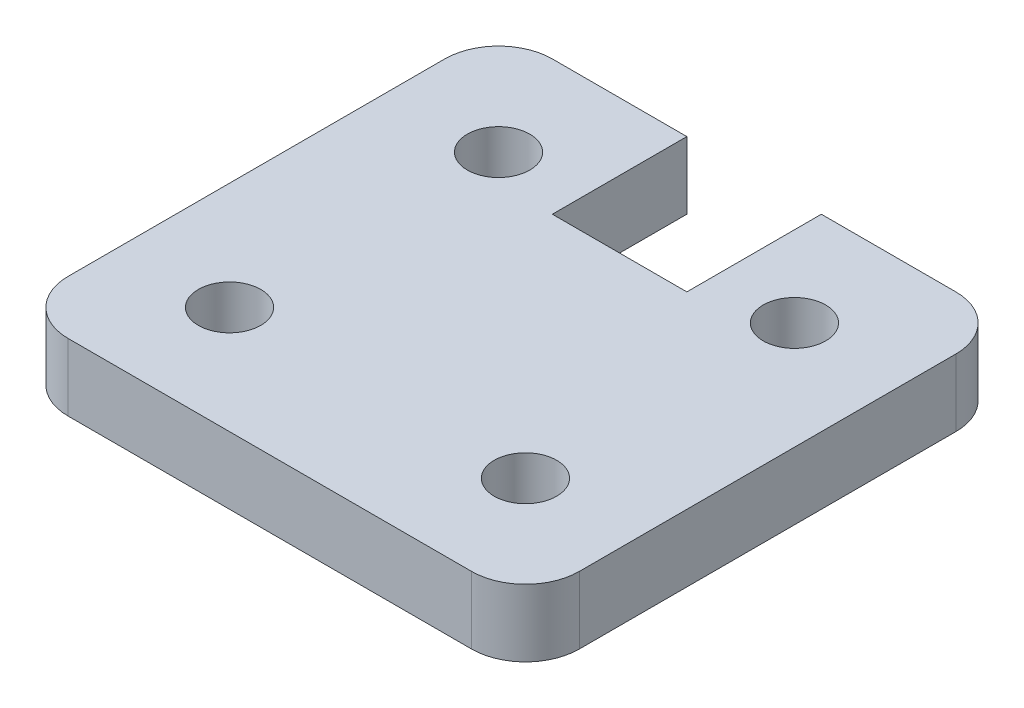
ISO-10303-21;
HEADER;
FILE_DESCRIPTION(('STEP AP214'),'2;1');
FILE_NAME('part.step','',(''),(''),'','','');
FILE_SCHEMA(('AUTOMOTIVE_DESIGN { 1 0 10303 214 1 1 1 1 }'));
ENDSEC;
DATA;
#1=APPLICATION_CONTEXT('core data for automotive mechanical design processes');
#2=APPLICATION_PROTOCOL_DEFINITION('international standard','automotive_design',2000,#1);
#3=PRODUCT_CONTEXT('',#1,'mechanical');
#4=PRODUCT('Part','Part','',(#3));
#5=PRODUCT_RELATED_PRODUCT_CATEGORY('part','',(#4));
#6=PRODUCT_DEFINITION_FORMATION('','',#4);
#7=PRODUCT_DEFINITION_CONTEXT('part definition',#1,'design');
#8=PRODUCT_DEFINITION('design','',#6,#7);
#9=PRODUCT_DEFINITION_SHAPE('','',#8);
#10=(LENGTH_UNIT() NAMED_UNIT(*) SI_UNIT(.MILLI.,.METRE.));
#11=(NAMED_UNIT(*) PLANE_ANGLE_UNIT() SI_UNIT($,.RADIAN.));
#12=(NAMED_UNIT(*) SI_UNIT($,.STERADIAN.) SOLID_ANGLE_UNIT());
#13=UNCERTAINTY_MEASURE_WITH_UNIT(LENGTH_MEASURE(1.E-05),#10,'distance_accuracy_value','');
#14=(GEOMETRIC_REPRESENTATION_CONTEXT(3) GLOBAL_UNCERTAINTY_ASSIGNED_CONTEXT((#13)) GLOBAL_UNIT_ASSIGNED_CONTEXT((#10,
#11,#12)) REPRESENTATION_CONTEXT('',''));
#15=CARTESIAN_POINT('',(0.,0.,0.));
#16=DIRECTION('',(0.,0.,1.));
#17=DIRECTION('',(1.,0.,0.));
#18=AXIS2_PLACEMENT_3D('',#15,#16,#17);
#19=CARTESIAN_POINT('',(-12.065,3.175,-11.43));
#20=DIRECTION('',(0.,0.,1.));
#21=DIRECTION('',(1.,0.,0.));
#22=AXIS2_PLACEMENT_3D('',#19,#20,#21);
#23=PLANE('',#22);
#24=DIRECTION('',(-1.,0.,0.));
#25=VECTOR('',#24,1.);
#26=CARTESIAN_POINT('',(-12.065,0.,-11.43));
#27=LINE('',#26,#25);
#28=CARTESIAN_POINT('',(9.525,0.,-11.43));
#29=VERTEX_POINT('',#28);
#30=CARTESIAN_POINT('',(3.17499999999999,0.,-11.43));
#31=VERTEX_POINT('',#30);
#32=EDGE_CURVE('E144',#29,#31,#27,.T.);
#33=ORIENTED_EDGE('',*,*,#32,.T.);
#34=DIRECTION('',(0.,1.,0.));
#35=VECTOR('',#34,1.);
#36=CARTESIAN_POINT('',(3.17499999999999,0.,-11.43));
#37=LINE('',#36,#35);
#38=CARTESIAN_POINT('',(3.17499999999999,3.175,-11.43));
#39=VERTEX_POINT('',#38);
#40=EDGE_CURVE('E128',#31,#39,#37,.T.);
#41=ORIENTED_EDGE('',*,*,#40,.T.);
#42=DIRECTION('',(-1.,0.,0.));
#43=VECTOR('',#42,1.);
#44=CARTESIAN_POINT('',(-12.065,3.175,-11.43));
#45=LINE('',#44,#43);
#46=CARTESIAN_POINT('',(9.525,3.175,-11.43));
#47=VERTEX_POINT('',#46);
#48=EDGE_CURVE('E217',#47,#39,#45,.T.);
#49=ORIENTED_EDGE('',*,*,#48,.F.);
#50=DIRECTION('',(0.,-1.,0.));
#51=VECTOR('',#50,1.);
#52=CARTESIAN_POINT('',(9.525,3.175,-11.43));
#53=LINE('',#52,#51);
#54=EDGE_CURVE('E151',#47,#29,#53,.T.);
#55=ORIENTED_EDGE('',*,*,#54,.T.);
#56=EDGE_LOOP('',(#33,#41,#49,#55));
#57=FACE_BOUND('',#56,.T.);
#58=ADVANCED_FACE('F39',(#57),#23,.F.);
#59=CARTESIAN_POINT('',(12.065,3.175,11.43));
#60=DIRECTION('',(-1.,0.,0.));
#61=DIRECTION('',(0.,0.,1.));
#62=AXIS2_PLACEMENT_3D('',#59,#60,#61);
#63=PLANE('',#62);
#64=DIRECTION('',(0.,0.,-1.));
#65=VECTOR('',#64,1.);
#66=CARTESIAN_POINT('',(12.065,0.,11.43));
#67=LINE('',#66,#65);
#68=CARTESIAN_POINT('',(12.065,0.,8.89));
#69=VERTEX_POINT('',#68);
#70=CARTESIAN_POINT('',(12.065,0.,-8.89));
#71=VERTEX_POINT('',#70);
#72=EDGE_CURVE('E158',#69,#71,#67,.T.);
#73=ORIENTED_EDGE('',*,*,#72,.T.);
#74=DIRECTION('',(0.,-1.,0.));
#75=VECTOR('',#74,1.);
#76=CARTESIAN_POINT('',(12.065,3.175,-8.89));
#77=LINE('',#76,#75);
#78=CARTESIAN_POINT('',(12.065,3.175,-8.89));
#79=VERTEX_POINT('',#78);
#80=EDGE_CURVE('E194',#71,#79,#77,.F.);
#81=ORIENTED_EDGE('',*,*,#80,.T.);
#82=DIRECTION('',(0.,0.,-1.));
#83=VECTOR('',#82,1.);
#84=CARTESIAN_POINT('',(12.065,3.175,11.43));
#85=LINE('',#84,#83);
#86=CARTESIAN_POINT('',(12.065,3.175,8.89));
#87=VERTEX_POINT('',#86);
#88=EDGE_CURVE('E163',#87,#79,#85,.T.);
#89=ORIENTED_EDGE('',*,*,#88,.F.);
#90=DIRECTION('',(0.,-1.,0.));
#91=VECTOR('',#90,1.);
#92=CARTESIAN_POINT('',(12.065,3.175,8.89));
#93=LINE('',#92,#91);
#94=EDGE_CURVE('E191',#87,#69,#93,.T.);
#95=ORIENTED_EDGE('',*,*,#94,.T.);
#96=EDGE_LOOP('',(#73,#81,#89,#95));
#97=FACE_BOUND('',#96,.T.);
#98=ADVANCED_FACE('F210',(#97),#63,.F.);
#99=CARTESIAN_POINT('',(-3.17500000000001,3.175,-11.43));
#100=VERTEX_POINT('',#99);
#101=CARTESIAN_POINT('',(-9.525,3.175,-11.43));
#102=VERTEX_POINT('',#101);
#103=EDGE_CURVE('E215',#100,#102,#45,.T.);
#104=ORIENTED_EDGE('',*,*,#103,.F.);
#105=DIRECTION('',(0.,1.,0.));
#106=VECTOR('',#105,1.);
#107=CARTESIAN_POINT('',(-3.17500000000001,0.,-11.43));
#108=LINE('',#107,#106);
#109=CARTESIAN_POINT('',(-3.17500000000001,0.,-11.43));
#110=VERTEX_POINT('',#109);
#111=EDGE_CURVE('E138',#110,#100,#108,.T.);
#112=ORIENTED_EDGE('',*,*,#111,.F.);
#113=CARTESIAN_POINT('',(-9.525,0.,-11.43));
#114=VERTEX_POINT('',#113);
#115=EDGE_CURVE('E153',#110,#114,#27,.T.);
#116=ORIENTED_EDGE('',*,*,#115,.T.);
#117=DIRECTION('',(0.,-1.,0.));
#118=VECTOR('',#117,1.);
#119=CARTESIAN_POINT('',(-9.525,3.175,-11.43));
#120=LINE('',#119,#118);
#121=EDGE_CURVE('E180',#114,#102,#120,.F.);
#122=ORIENTED_EDGE('',*,*,#121,.T.);
#123=EDGE_LOOP('',(#104,#112,#116,#122));
#124=FACE_BOUND('',#123,.T.);
#125=ADVANCED_FACE('F238',(#124),#23,.F.);
#126=CARTESIAN_POINT('',(-12.065,3.175,11.43));
#127=DIRECTION('',(1.,0.,0.));
#128=DIRECTION('',(0.,0.,-1.));
#129=AXIS2_PLACEMENT_3D('',#126,#127,#128);
#130=PLANE('',#129);
#131=DIRECTION('',(0.,0.,1.));
#132=VECTOR('',#131,1.);
#133=CARTESIAN_POINT('',(-12.065,3.175,11.43));
#134=LINE('',#133,#132);
#135=CARTESIAN_POINT('',(-12.065,3.175,-8.89));
#136=VERTEX_POINT('',#135);
#137=CARTESIAN_POINT('',(-12.065,3.175,8.89));
#138=VERTEX_POINT('',#137);
#139=EDGE_CURVE('E223',#136,#138,#134,.T.);
#140=ORIENTED_EDGE('',*,*,#139,.F.);
#141=DIRECTION('',(0.,-1.,0.));
#142=VECTOR('',#141,1.);
#143=CARTESIAN_POINT('',(-12.065,3.175,-8.89));
#144=LINE('',#143,#142);
#145=CARTESIAN_POINT('',(-12.065,0.,-8.89));
#146=VERTEX_POINT('',#145);
#147=EDGE_CURVE('E166',#136,#146,#144,.T.);
#148=ORIENTED_EDGE('',*,*,#147,.T.);
#149=DIRECTION('',(0.,0.,1.));
#150=VECTOR('',#149,1.);
#151=CARTESIAN_POINT('',(-12.065,0.,11.43));
#152=LINE('',#151,#150);
#153=CARTESIAN_POINT('',(-12.065,0.,8.89));
#154=VERTEX_POINT('',#153);
#155=EDGE_CURVE('E152',#146,#154,#152,.T.);
#156=ORIENTED_EDGE('',*,*,#155,.T.);
#157=DIRECTION('',(0.,-1.,0.));
#158=VECTOR('',#157,1.);
#159=CARTESIAN_POINT('',(-12.065,3.175,8.89));
#160=LINE('',#159,#158);
#161=EDGE_CURVE('E164',#154,#138,#160,.F.);
#162=ORIENTED_EDGE('',*,*,#161,.T.);
#163=EDGE_LOOP('',(#140,#148,#156,#162));
#164=FACE_BOUND('',#163,.T.);
#165=ADVANCED_FACE('F229',(#164),#130,.F.);
#166=CARTESIAN_POINT('',(-12.065,3.175,11.43));
#167=DIRECTION('',(0.,0.,-1.));
#168=DIRECTION('',(-1.,0.,0.));
#169=AXIS2_PLACEMENT_3D('',#166,#167,#168);
#170=PLANE('',#169);
#171=DIRECTION('',(1.,0.,0.));
#172=VECTOR('',#171,1.);
#173=CARTESIAN_POINT('',(-12.065,0.,11.43));
#174=LINE('',#173,#172);
#175=CARTESIAN_POINT('',(-9.525,0.,11.43));
#176=VERTEX_POINT('',#175);
#177=CARTESIAN_POINT('',(9.525,0.,11.43));
#178=VERTEX_POINT('',#177);
#179=EDGE_CURVE('E156',#176,#178,#174,.T.);
#180=ORIENTED_EDGE('',*,*,#179,.T.);
#181=DIRECTION('',(0.,-1.,0.));
#182=VECTOR('',#181,1.);
#183=CARTESIAN_POINT('',(9.525,3.175,11.43));
#184=LINE('',#183,#182);
#185=CARTESIAN_POINT('',(9.525,3.175,11.43));
#186=VERTEX_POINT('',#185);
#187=EDGE_CURVE('E11',#178,#186,#184,.F.);
#188=ORIENTED_EDGE('',*,*,#187,.T.);
#189=DIRECTION('',(1.,0.,0.));
#190=VECTOR('',#189,1.);
#191=CARTESIAN_POINT('',(-12.065,3.175,11.43));
#192=LINE('',#191,#190);
#193=CARTESIAN_POINT('',(-9.525,3.175,11.43));
#194=VERTEX_POINT('',#193);
#195=EDGE_CURVE('E167',#194,#186,#192,.T.);
#196=ORIENTED_EDGE('',*,*,#195,.F.);
#197=DIRECTION('',(0.,-1.,0.));
#198=VECTOR('',#197,1.);
#199=CARTESIAN_POINT('',(-9.525,3.175,11.43));
#200=LINE('',#199,#198);
#201=EDGE_CURVE('E47',#194,#176,#200,.T.);
#202=ORIENTED_EDGE('',*,*,#201,.T.);
#203=EDGE_LOOP('',(#180,#188,#196,#202));
#204=FACE_BOUND('',#203,.T.);
#205=ADVANCED_FACE('F198',(#204),#170,.F.);
#206=CARTESIAN_POINT('',(0.,3.175,0.));
#207=DIRECTION('',(0.,-1.,0.));
#208=DIRECTION('',(0.,0.,-1.));
#209=AXIS2_PLACEMENT_3D('',#206,#207,#208);
#210=PLANE('',#209);
#211=CARTESIAN_POINT('',(6.985,3.175,-6.35));
#212=DIRECTION('',(0.,1.,0.));
#213=DIRECTION('',(0.,0.,-1.));
#214=AXIS2_PLACEMENT_3D('',#211,#212,#213);
#215=CIRCLE('',#214,1.4732);
#216=CARTESIAN_POINT('',(6.985,3.175,-7.8232));
#217=VERTEX_POINT('',#216);
#218=EDGE_CURVE('E261',#217,#217,#215,.T.);
#219=ORIENTED_EDGE('',*,*,#218,.F.);
#220=EDGE_LOOP('',(#219));
#221=FACE_BOUND('',#220,.T.);
#222=CARTESIAN_POINT('',(6.985,3.175,6.35));
#223=DIRECTION('',(0.,1.,0.));
#224=DIRECTION('',(0.,0.,1.));
#225=AXIS2_PLACEMENT_3D('',#222,#223,#224);
#226=CIRCLE('',#225,1.4732);
#227=CARTESIAN_POINT('',(6.985,3.175,7.8232));
#228=VERTEX_POINT('',#227);
#229=EDGE_CURVE('E255',#228,#228,#226,.T.);
#230=ORIENTED_EDGE('',*,*,#229,.F.);
#231=EDGE_LOOP('',(#230));
#232=FACE_BOUND('',#231,.T.);
#233=CARTESIAN_POINT('',(-6.985,3.175,6.35));
#234=DIRECTION('',(0.,1.,0.));
#235=DIRECTION('',(0.,0.,-1.));
#236=AXIS2_PLACEMENT_3D('',#233,#234,#235);
#237=CIRCLE('',#236,1.4732);
#238=CARTESIAN_POINT('',(-6.985,3.175,4.8768));
#239=VERTEX_POINT('',#238);
#240=EDGE_CURVE('E249',#239,#239,#237,.T.);
#241=ORIENTED_EDGE('',*,*,#240,.F.);
#242=EDGE_LOOP('',(#241));
#243=FACE_BOUND('',#242,.T.);
#244=CARTESIAN_POINT('',(-6.985,3.175,-6.35));
#245=DIRECTION('',(0.,1.,0.));
#246=DIRECTION('',(0.,0.,1.));
#247=AXIS2_PLACEMENT_3D('',#244,#245,#246);
#248=CIRCLE('',#247,1.4732);
#249=CARTESIAN_POINT('',(-6.985,3.175,-4.8768));
#250=VERTEX_POINT('',#249);
#251=EDGE_CURVE('E220',#250,#250,#248,.T.);
#252=ORIENTED_EDGE('',*,*,#251,.F.);
#253=EDGE_LOOP('',(#252));
#254=FACE_BOUND('',#253,.T.);
#255=ORIENTED_EDGE('',*,*,#48,.T.);
#256=DIRECTION('',(0.,0.,-1.));
#257=VECTOR('',#256,1.);
#258=CARTESIAN_POINT('',(3.17499999999999,3.175,-11.43));
#259=LINE('',#258,#257);
#260=CARTESIAN_POINT('',(3.17499999999999,3.175,-5.08));
#261=VERTEX_POINT('',#260);
#262=EDGE_CURVE('E133',#261,#39,#259,.T.);
#263=ORIENTED_EDGE('',*,*,#262,.F.);
#264=DIRECTION('',(1.,0.,0.));
#265=VECTOR('',#264,1.);
#266=CARTESIAN_POINT('',(3.17499999999999,3.175,-5.08));
#267=LINE('',#266,#265);
#268=CARTESIAN_POINT('',(-3.17500000000001,3.175,-5.08));
#269=VERTEX_POINT('',#268);
#270=EDGE_CURVE('E147',#269,#261,#267,.T.);
#271=ORIENTED_EDGE('',*,*,#270,.F.);
#272=DIRECTION('',(0.,0.,1.));
#273=VECTOR('',#272,1.);
#274=CARTESIAN_POINT('',(-3.17500000000001,3.175,-11.43));
#275=LINE('',#274,#273);
#276=EDGE_CURVE('E441',#100,#269,#275,.T.);
#277=ORIENTED_EDGE('',*,*,#276,.F.);
#278=ORIENTED_EDGE('',*,*,#103,.T.);
#279=CARTESIAN_POINT('',(-9.525,3.175,-8.89));
#280=DIRECTION('',(0.,-1.,0.));
#281=DIRECTION('',(0.,0.,-1.));
#282=AXIS2_PLACEMENT_3D('',#279,#280,#281);
#283=CIRCLE('',#282,2.54);
#284=EDGE_CURVE('E189',#102,#136,#283,.F.);
#285=ORIENTED_EDGE('',*,*,#284,.T.);
#286=ORIENTED_EDGE('',*,*,#139,.T.);
#287=CARTESIAN_POINT('',(-9.525,3.175,8.89));
#288=DIRECTION('',(0.,-1.,0.));
#289=DIRECTION('',(0.,0.,-1.));
#290=AXIS2_PLACEMENT_3D('',#287,#288,#289);
#291=CIRCLE('',#290,2.54);
#292=EDGE_CURVE('E183',#138,#194,#291,.F.);
#293=ORIENTED_EDGE('',*,*,#292,.T.);
#294=ORIENTED_EDGE('',*,*,#195,.T.);
#295=CARTESIAN_POINT('',(9.525,3.175,8.89));
#296=DIRECTION('',(0.,-1.,0.));
#297=DIRECTION('',(0.,0.,-1.));
#298=AXIS2_PLACEMENT_3D('',#295,#296,#297);
#299=CIRCLE('',#298,2.54);
#300=EDGE_CURVE('E185',#186,#87,#299,.F.);
#301=ORIENTED_EDGE('',*,*,#300,.T.);
#302=ORIENTED_EDGE('',*,*,#88,.T.);
#303=CARTESIAN_POINT('',(9.525,3.175,-8.89));
#304=DIRECTION('',(0.,-1.,0.));
#305=DIRECTION('',(0.,0.,-1.));
#306=AXIS2_PLACEMENT_3D('',#303,#304,#305);
#307=CIRCLE('',#306,2.54);
#308=EDGE_CURVE('E187',#79,#47,#307,.F.);
#309=ORIENTED_EDGE('',*,*,#308,.T.);
#310=EDGE_LOOP('',(#255,#263,#271,#277,#278,#285,#286,#293,#294,#301,#302,#309));
#311=FACE_BOUND('',#310,.T.);
#312=ADVANCED_FACE('F225',(#221,#232,#243,#254,#311),#210,.F.);
#313=CARTESIAN_POINT('',(0.,0.,0.));
#314=DIRECTION('',(0.,-1.,0.));
#315=DIRECTION('',(0.,0.,-1.));
#316=AXIS2_PLACEMENT_3D('',#313,#314,#315);
#317=PLANE('',#316);
#318=DIRECTION('',(0.,0.,-1.));
#319=VECTOR('',#318,1.);
#320=CARTESIAN_POINT('',(3.17499999999999,0.,-11.43));
#321=LINE('',#320,#319);
#322=CARTESIAN_POINT('',(3.17499999999999,0.,-5.08));
#323=VERTEX_POINT('',#322);
#324=EDGE_CURVE('E131',#323,#31,#321,.T.);
#325=ORIENTED_EDGE('',*,*,#324,.T.);
#326=ORIENTED_EDGE('',*,*,#32,.F.);
#327=CARTESIAN_POINT('',(9.525,0.,-8.89));
#328=DIRECTION('',(0.,-1.,0.));
#329=DIRECTION('',(0.,0.,-1.));
#330=AXIS2_PLACEMENT_3D('',#327,#328,#329);
#331=CIRCLE('',#330,2.54);
#332=EDGE_CURVE('E174',#29,#71,#331,.T.);
#333=ORIENTED_EDGE('',*,*,#332,.T.);
#334=ORIENTED_EDGE('',*,*,#72,.F.);
#335=CARTESIAN_POINT('',(9.525,0.,8.89));
#336=DIRECTION('',(0.,-1.,0.));
#337=DIRECTION('',(0.,0.,-1.));
#338=AXIS2_PLACEMENT_3D('',#335,#336,#337);
#339=CIRCLE('',#338,2.54);
#340=EDGE_CURVE('E172',#69,#178,#339,.T.);
#341=ORIENTED_EDGE('',*,*,#340,.T.);
#342=ORIENTED_EDGE('',*,*,#179,.F.);
#343=CARTESIAN_POINT('',(-9.525,0.,8.89));
#344=DIRECTION('',(0.,-1.,0.));
#345=DIRECTION('',(0.,0.,-1.));
#346=AXIS2_PLACEMENT_3D('',#343,#344,#345);
#347=CIRCLE('',#346,2.54);
#348=EDGE_CURVE('E170',#176,#154,#347,.T.);
#349=ORIENTED_EDGE('',*,*,#348,.T.);
#350=ORIENTED_EDGE('',*,*,#155,.F.);
#351=CARTESIAN_POINT('',(-9.525,0.,-8.89));
#352=DIRECTION('',(0.,-1.,0.));
#353=DIRECTION('',(0.,0.,-1.));
#354=AXIS2_PLACEMENT_3D('',#351,#352,#353);
#355=CIRCLE('',#354,2.54);
#356=EDGE_CURVE('E176',#146,#114,#355,.T.);
#357=ORIENTED_EDGE('',*,*,#356,.T.);
#358=ORIENTED_EDGE('',*,*,#115,.F.);
#359=DIRECTION('',(0.,0.,1.));
#360=VECTOR('',#359,1.);
#361=CARTESIAN_POINT('',(-3.17500000000001,0.,-11.43));
#362=LINE('',#361,#360);
#363=CARTESIAN_POINT('',(-3.17500000000001,0.,-5.08));
#364=VERTEX_POINT('',#363);
#365=EDGE_CURVE('E146',#110,#364,#362,.T.);
#366=ORIENTED_EDGE('',*,*,#365,.T.);
#367=DIRECTION('',(1.,0.,0.));
#368=VECTOR('',#367,1.);
#369=CARTESIAN_POINT('',(3.17499999999999,0.,-5.08));
#370=LINE('',#369,#368);
#371=EDGE_CURVE('E54',#364,#323,#370,.T.);
#372=ORIENTED_EDGE('',*,*,#371,.T.);
#373=EDGE_LOOP('',(#325,#326,#333,#334,#341,#342,#349,#350,#357,#358,#366,#372));
#374=FACE_BOUND('',#373,.T.);
#375=CARTESIAN_POINT('',(6.985,0.,-6.35));
#376=DIRECTION('',(0.,1.,0.));
#377=DIRECTION('',(0.,0.,-1.));
#378=AXIS2_PLACEMENT_3D('',#375,#376,#377);
#379=CIRCLE('',#378,1.4732);
#380=CARTESIAN_POINT('',(6.985,0.,-7.8232));
#381=VERTEX_POINT('',#380);
#382=EDGE_CURVE('E264',#381,#381,#379,.T.);
#383=ORIENTED_EDGE('',*,*,#382,.T.);
#384=EDGE_LOOP('',(#383));
#385=FACE_BOUND('',#384,.T.);
#386=CARTESIAN_POINT('',(6.985,0.,6.35));
#387=DIRECTION('',(0.,1.,0.));
#388=DIRECTION('',(0.,0.,1.));
#389=AXIS2_PLACEMENT_3D('',#386,#387,#388);
#390=CIRCLE('',#389,1.4732);
#391=CARTESIAN_POINT('',(6.985,0.,7.8232));
#392=VERTEX_POINT('',#391);
#393=EDGE_CURVE('E258',#392,#392,#390,.T.);
#394=ORIENTED_EDGE('',*,*,#393,.T.);
#395=EDGE_LOOP('',(#394));
#396=FACE_BOUND('',#395,.T.);
#397=CARTESIAN_POINT('',(-6.985,0.,6.35));
#398=DIRECTION('',(0.,1.,0.));
#399=DIRECTION('',(0.,0.,-1.));
#400=AXIS2_PLACEMENT_3D('',#397,#398,#399);
#401=CIRCLE('',#400,1.4732);
#402=CARTESIAN_POINT('',(-6.985,0.,4.8768));
#403=VERTEX_POINT('',#402);
#404=EDGE_CURVE('E252',#403,#403,#401,.T.);
#405=ORIENTED_EDGE('',*,*,#404,.T.);
#406=EDGE_LOOP('',(#405));
#407=FACE_BOUND('',#406,.T.);
#408=CARTESIAN_POINT('',(-6.985,0.,-6.35));
#409=DIRECTION('',(0.,1.,0.));
#410=DIRECTION('',(0.,0.,1.));
#411=AXIS2_PLACEMENT_3D('',#408,#409,#410);
#412=CIRCLE('',#411,1.4732);
#413=CARTESIAN_POINT('',(-6.985,0.,-4.8768));
#414=VERTEX_POINT('',#413);
#415=EDGE_CURVE('E266',#414,#414,#412,.T.);
#416=ORIENTED_EDGE('',*,*,#415,.T.);
#417=EDGE_LOOP('',(#416));
#418=FACE_BOUND('',#417,.T.);
#419=ADVANCED_FACE('F142',(#374,#385,#396,#407,#418),#317,.T.);
#420=CARTESIAN_POINT('',(-6.985,0.,-6.35));
#421=DIRECTION('',(0.,1.,0.));
#422=DIRECTION('',(0.,0.,1.));
#423=AXIS2_PLACEMENT_3D('',#420,#421,#422);
#424=CYLINDRICAL_SURFACE('',#423,1.4732);
#425=ORIENTED_EDGE('',*,*,#415,.F.);
#426=EDGE_LOOP('',(#425));
#427=FACE_BOUND('',#426,.T.);
#428=ORIENTED_EDGE('',*,*,#251,.T.);
#429=EDGE_LOOP('',(#428));
#430=FACE_BOUND('',#429,.T.);
#431=ADVANCED_FACE('F273',(#427,#430),#424,.F.);
#432=CARTESIAN_POINT('',(-6.985,0.,6.35));
#433=DIRECTION('',(0.,1.,0.));
#434=DIRECTION('',(0.,0.,1.));
#435=AXIS2_PLACEMENT_3D('',#432,#433,#434);
#436=CYLINDRICAL_SURFACE('',#435,1.4732);
#437=ORIENTED_EDGE('',*,*,#404,.F.);
#438=EDGE_LOOP('',(#437));
#439=FACE_BOUND('',#438,.T.);
#440=ORIENTED_EDGE('',*,*,#240,.T.);
#441=EDGE_LOOP('',(#440));
#442=FACE_BOUND('',#441,.T.);
#443=ADVANCED_FACE('F373',(#439,#442),#436,.F.);
#444=CARTESIAN_POINT('',(6.985,0.,6.35));
#445=DIRECTION('',(0.,1.,0.));
#446=DIRECTION('',(0.,0.,1.));
#447=AXIS2_PLACEMENT_3D('',#444,#445,#446);
#448=CYLINDRICAL_SURFACE('',#447,1.4732);
#449=ORIENTED_EDGE('',*,*,#393,.F.);
#450=EDGE_LOOP('',(#449));
#451=FACE_BOUND('',#450,.T.);
#452=ORIENTED_EDGE('',*,*,#229,.T.);
#453=EDGE_LOOP('',(#452));
#454=FACE_BOUND('',#453,.T.);
#455=ADVANCED_FACE('F376',(#451,#454),#448,.F.);
#456=CARTESIAN_POINT('',(6.985,0.,-6.35));
#457=DIRECTION('',(0.,1.,0.));
#458=DIRECTION('',(0.,0.,1.));
#459=AXIS2_PLACEMENT_3D('',#456,#457,#458);
#460=CYLINDRICAL_SURFACE('',#459,1.4732);
#461=ORIENTED_EDGE('',*,*,#382,.F.);
#462=EDGE_LOOP('',(#461));
#463=FACE_BOUND('',#462,.T.);
#464=ORIENTED_EDGE('',*,*,#218,.T.);
#465=EDGE_LOOP('',(#464));
#466=FACE_BOUND('',#465,.T.);
#467=ADVANCED_FACE('F317',(#463,#466),#460,.F.);
#468=CARTESIAN_POINT('',(-9.525,3.175,-8.89));
#469=DIRECTION('',(0.,-1.,0.));
#470=DIRECTION('',(0.,0.,-1.));
#471=AXIS2_PLACEMENT_3D('',#468,#469,#470);
#472=CYLINDRICAL_SURFACE('',#471,2.54);
#473=ORIENTED_EDGE('',*,*,#284,.F.);
#474=ORIENTED_EDGE('',*,*,#121,.F.);
#475=ORIENTED_EDGE('',*,*,#356,.F.);
#476=ORIENTED_EDGE('',*,*,#147,.F.);
#477=EDGE_LOOP('',(#473,#474,#475,#476));
#478=FACE_BOUND('',#477,.T.);
#479=ADVANCED_FACE('F235',(#478),#472,.T.);
#480=CARTESIAN_POINT('',(9.525,3.175,-8.89));
#481=DIRECTION('',(0.,-1.,0.));
#482=DIRECTION('',(0.,0.,-1.));
#483=AXIS2_PLACEMENT_3D('',#480,#481,#482);
#484=CYLINDRICAL_SURFACE('',#483,2.54);
#485=ORIENTED_EDGE('',*,*,#308,.F.);
#486=ORIENTED_EDGE('',*,*,#80,.F.);
#487=ORIENTED_EDGE('',*,*,#332,.F.);
#488=ORIENTED_EDGE('',*,*,#54,.F.);
#489=EDGE_LOOP('',(#485,#486,#487,#488));
#490=FACE_BOUND('',#489,.T.);
#491=ADVANCED_FACE('F316',(#490),#484,.T.);
#492=CARTESIAN_POINT('',(9.525,3.175,8.89));
#493=DIRECTION('',(0.,-1.,0.));
#494=DIRECTION('',(0.,0.,-1.));
#495=AXIS2_PLACEMENT_3D('',#492,#493,#494);
#496=CYLINDRICAL_SURFACE('',#495,2.54);
#497=ORIENTED_EDGE('',*,*,#300,.F.);
#498=ORIENTED_EDGE('',*,*,#187,.F.);
#499=ORIENTED_EDGE('',*,*,#340,.F.);
#500=ORIENTED_EDGE('',*,*,#94,.F.);
#501=EDGE_LOOP('',(#497,#498,#499,#500));
#502=FACE_BOUND('',#501,.T.);
#503=ADVANCED_FACE('F207',(#502),#496,.T.);
#504=CARTESIAN_POINT('',(-9.525,3.175,8.89));
#505=DIRECTION('',(0.,-1.,0.));
#506=DIRECTION('',(0.,0.,-1.));
#507=AXIS2_PLACEMENT_3D('',#504,#505,#506);
#508=CYLINDRICAL_SURFACE('',#507,2.54);
#509=ORIENTED_EDGE('',*,*,#292,.F.);
#510=ORIENTED_EDGE('',*,*,#161,.F.);
#511=ORIENTED_EDGE('',*,*,#348,.F.);
#512=ORIENTED_EDGE('',*,*,#201,.F.);
#513=EDGE_LOOP('',(#509,#510,#511,#512));
#514=FACE_BOUND('',#513,.T.);
#515=ADVANCED_FACE('F41',(#514),#508,.T.);
#516=CARTESIAN_POINT('',(3.17499999999999,0.,-11.43));
#517=DIRECTION('',(1.,0.,0.));
#518=DIRECTION('',(0.,0.,-1.));
#519=AXIS2_PLACEMENT_3D('',#516,#517,#518);
#520=PLANE('',#519);
#521=ORIENTED_EDGE('',*,*,#262,.T.);
#522=ORIENTED_EDGE('',*,*,#40,.F.);
#523=ORIENTED_EDGE('',*,*,#324,.F.);
#524=DIRECTION('',(0.,1.,0.));
#525=VECTOR('',#524,1.);
#526=CARTESIAN_POINT('',(3.17499999999999,0.,-5.08));
#527=LINE('',#526,#525);
#528=EDGE_CURVE('E245',#323,#261,#527,.T.);
#529=ORIENTED_EDGE('',*,*,#528,.T.);
#530=EDGE_LOOP('',(#521,#522,#523,#529));
#531=FACE_BOUND('',#530,.T.);
#532=ADVANCED_FACE('F130',(#531),#520,.F.);
#533=CARTESIAN_POINT('',(3.17499999999999,0.,-5.08));
#534=DIRECTION('',(0.,0.,1.));
#535=DIRECTION('',(1.,0.,0.));
#536=AXIS2_PLACEMENT_3D('',#533,#534,#535);
#537=PLANE('',#536);
#538=ORIENTED_EDGE('',*,*,#270,.T.);
#539=ORIENTED_EDGE('',*,*,#528,.F.);
#540=ORIENTED_EDGE('',*,*,#371,.F.);
#541=DIRECTION('',(0.,1.,0.));
#542=VECTOR('',#541,1.);
#543=CARTESIAN_POINT('',(-3.17500000000001,0.,-5.08));
#544=LINE('',#543,#542);
#545=EDGE_CURVE('E243',#364,#269,#544,.T.);
#546=ORIENTED_EDGE('',*,*,#545,.T.);
#547=EDGE_LOOP('',(#538,#539,#540,#546));
#548=FACE_BOUND('',#547,.T.);
#549=ADVANCED_FACE('F352',(#548),#537,.F.);
#550=CARTESIAN_POINT('',(-3.17500000000001,0.,-11.43));
#551=DIRECTION('',(-1.,0.,0.));
#552=DIRECTION('',(0.,0.,1.));
#553=AXIS2_PLACEMENT_3D('',#550,#551,#552);
#554=PLANE('',#553);
#555=ORIENTED_EDGE('',*,*,#276,.T.);
#556=ORIENTED_EDGE('',*,*,#545,.F.);
#557=ORIENTED_EDGE('',*,*,#365,.F.);
#558=ORIENTED_EDGE('',*,*,#111,.T.);
#559=EDGE_LOOP('',(#555,#556,#557,#558));
#560=FACE_BOUND('',#559,.T.);
#561=ADVANCED_FACE('F361',(#560),#554,.F.);
#562=CLOSED_SHELL('',(#58,#98,#125,#165,#205,#312,#419,#431,#443,#455,#467,#479,#491,#503,#515,
#532,#549,#561));
#563=MANIFOLD_SOLID_BREP('B2',#562);
#564=ADVANCED_BREP_SHAPE_REPRESENTATION('',(#18,#563),#14);
#565=SHAPE_DEFINITION_REPRESENTATION(#9,#564);
ENDSEC;
END-ISO-10303-21;
